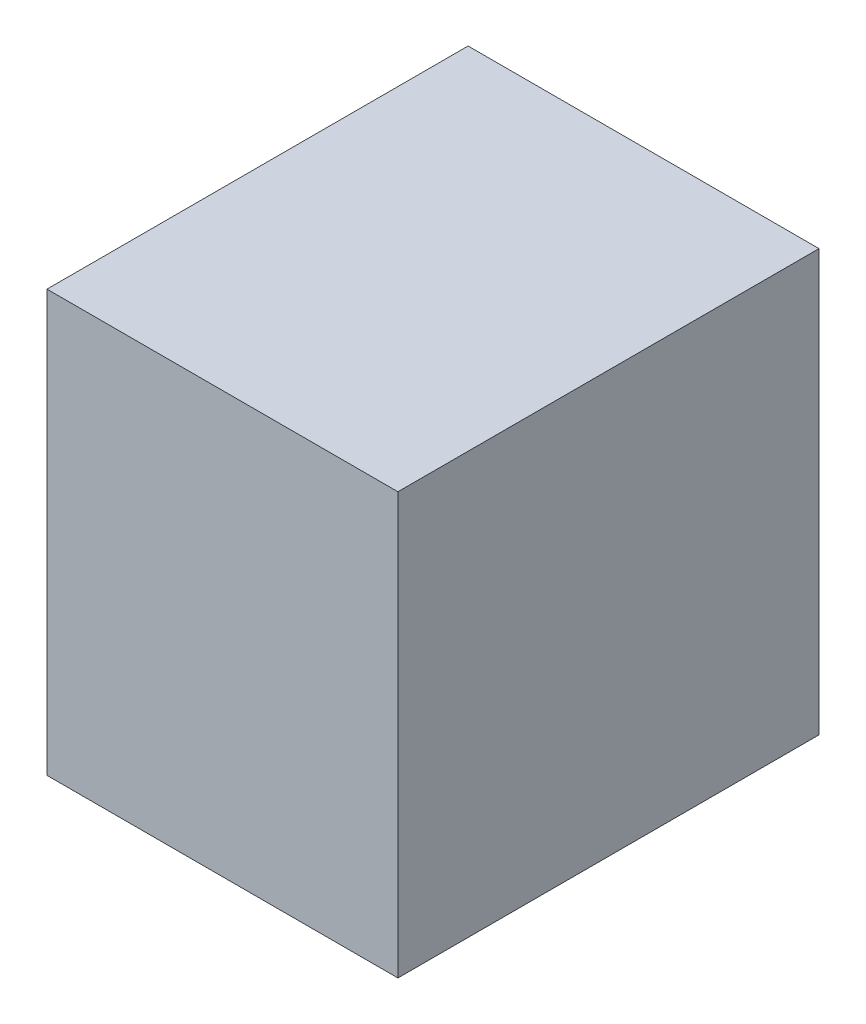
ISO-10303-21;
HEADER;
FILE_DESCRIPTION(('STEP AP214'),'2;1');
FILE_NAME('part.step','',(''),(''),'','','');
FILE_SCHEMA(('AUTOMOTIVE_DESIGN { 1 0 10303 214 1 1 1 1 }'));
ENDSEC;
DATA;
#1=APPLICATION_CONTEXT('core data for automotive mechanical design processes');
#2=APPLICATION_PROTOCOL_DEFINITION('international standard','automotive_design',2000,#1);
#3=PRODUCT_CONTEXT('',#1,'mechanical');
#4=PRODUCT('Part','Part','',(#3));
#5=PRODUCT_RELATED_PRODUCT_CATEGORY('part','',(#4));
#6=PRODUCT_DEFINITION_FORMATION('','',#4);
#7=PRODUCT_DEFINITION_CONTEXT('part definition',#1,'design');
#8=PRODUCT_DEFINITION('design','',#6,#7);
#9=PRODUCT_DEFINITION_SHAPE('','',#8);
#10=(LENGTH_UNIT() NAMED_UNIT(*) SI_UNIT(.MILLI.,.METRE.));
#11=(NAMED_UNIT(*) PLANE_ANGLE_UNIT() SI_UNIT($,.RADIAN.));
#12=(NAMED_UNIT(*) SI_UNIT($,.STERADIAN.) SOLID_ANGLE_UNIT());
#13=UNCERTAINTY_MEASURE_WITH_UNIT(LENGTH_MEASURE(1.E-05),#10,'distance_accuracy_value','');
#14=(GEOMETRIC_REPRESENTATION_CONTEXT(3) GLOBAL_UNCERTAINTY_ASSIGNED_CONTEXT((#13)) GLOBAL_UNIT_ASSIGNED_CONTEXT((#10,
#11,#12)) REPRESENTATION_CONTEXT('',''));
#15=CARTESIAN_POINT('',(0.,0.,0.));
#16=DIRECTION('',(0.,0.,1.));
#17=DIRECTION('',(1.,0.,0.));
#18=AXIS2_PLACEMENT_3D('',#15,#16,#17);
#19=CARTESIAN_POINT('',(-254.,609.6,304.8));
#20=DIRECTION('',(1.,0.,0.));
#21=DIRECTION('',(0.,0.,-1.));
#22=AXIS2_PLACEMENT_3D('',#19,#20,#21);
#23=PLANE('',#22);
#24=DIRECTION('',(0.,0.,1.));
#25=VECTOR('',#24,1.);
#26=CARTESIAN_POINT('',(-254.,0.,304.8));
#27=LINE('',#26,#25);
#28=CARTESIAN_POINT('',(-254.,0.,-304.8));
#29=VERTEX_POINT('',#28);
#30=CARTESIAN_POINT('',(-254.,0.,304.8));
#31=VERTEX_POINT('',#30);
#32=EDGE_CURVE('E100',#29,#31,#27,.T.);
#33=ORIENTED_EDGE('',*,*,#32,.T.);
#34=DIRECTION('',(0.,-1.,0.));
#35=VECTOR('',#34,1.);
#36=CARTESIAN_POINT('',(-254.,609.6,304.8));
#37=LINE('',#36,#35);
#38=CARTESIAN_POINT('',(-254.,609.6,304.8));
#39=VERTEX_POINT('',#38);
#40=EDGE_CURVE('E11',#39,#31,#37,.T.);
#41=ORIENTED_EDGE('',*,*,#40,.F.);
#42=DIRECTION('',(0.,0.,1.));
#43=VECTOR('',#42,1.);
#44=CARTESIAN_POINT('',(-254.,609.6,304.8));
#45=LINE('',#44,#43);
#46=CARTESIAN_POINT('',(-254.,609.6,-304.8));
#47=VERTEX_POINT('',#46);
#48=EDGE_CURVE('E88',#47,#39,#45,.T.);
#49=ORIENTED_EDGE('',*,*,#48,.F.);
#50=DIRECTION('',(0.,-1.,0.));
#51=VECTOR('',#50,1.);
#52=CARTESIAN_POINT('',(-254.,609.6,-304.8));
#53=LINE('',#52,#51);
#54=EDGE_CURVE('E96',#47,#29,#53,.T.);
#55=ORIENTED_EDGE('',*,*,#54,.T.);
#56=EDGE_LOOP('',(#33,#41,#49,#55));
#57=FACE_BOUND('',#56,.T.);
#58=ADVANCED_FACE('F37',(#57),#23,.F.);
#59=CARTESIAN_POINT('',(254.,609.6,304.8));
#60=DIRECTION('',(0.,0.,-1.));
#61=DIRECTION('',(-1.,0.,0.));
#62=AXIS2_PLACEMENT_3D('',#59,#60,#61);
#63=PLANE('',#62);
#64=DIRECTION('',(1.,0.,0.));
#65=VECTOR('',#64,1.);
#66=CARTESIAN_POINT('',(254.,0.,304.8));
#67=LINE('',#66,#65);
#68=CARTESIAN_POINT('',(254.,0.,304.8));
#69=VERTEX_POINT('',#68);
#70=EDGE_CURVE('E92',#31,#69,#67,.T.);
#71=ORIENTED_EDGE('',*,*,#70,.T.);
#72=DIRECTION('',(0.,-1.,0.));
#73=VECTOR('',#72,1.);
#74=CARTESIAN_POINT('',(254.,609.6,304.8));
#75=LINE('',#74,#73);
#76=CARTESIAN_POINT('',(254.,609.6,304.8));
#77=VERTEX_POINT('',#76);
#78=EDGE_CURVE('E45',#77,#69,#75,.T.);
#79=ORIENTED_EDGE('',*,*,#78,.F.);
#80=DIRECTION('',(1.,0.,0.));
#81=VECTOR('',#80,1.);
#82=CARTESIAN_POINT('',(254.,609.6,304.8));
#83=LINE('',#82,#81);
#84=EDGE_CURVE('E83',#39,#77,#83,.T.);
#85=ORIENTED_EDGE('',*,*,#84,.F.);
#86=ORIENTED_EDGE('',*,*,#40,.T.);
#87=EDGE_LOOP('',(#71,#79,#85,#86));
#88=FACE_BOUND('',#87,.T.);
#89=ADVANCED_FACE('F91',(#88),#63,.F.);
#90=CARTESIAN_POINT('',(254.,609.6,304.8));
#91=DIRECTION('',(-1.,0.,0.));
#92=DIRECTION('',(0.,0.,1.));
#93=AXIS2_PLACEMENT_3D('',#90,#91,#92);
#94=PLANE('',#93);
#95=DIRECTION('',(0.,0.,-1.));
#96=VECTOR('',#95,1.);
#97=CARTESIAN_POINT('',(254.,0.,304.8));
#98=LINE('',#97,#96);
#99=CARTESIAN_POINT('',(254.,0.,-304.8));
#100=VERTEX_POINT('',#99);
#101=EDGE_CURVE('E70',#69,#100,#98,.T.);
#102=ORIENTED_EDGE('',*,*,#101,.T.);
#103=DIRECTION('',(0.,-1.,0.));
#104=VECTOR('',#103,1.);
#105=CARTESIAN_POINT('',(254.,609.6,-304.8));
#106=LINE('',#105,#104);
#107=CARTESIAN_POINT('',(254.,609.6,-304.8));
#108=VERTEX_POINT('',#107);
#109=EDGE_CURVE('E93',#108,#100,#106,.T.);
#110=ORIENTED_EDGE('',*,*,#109,.F.);
#111=DIRECTION('',(0.,0.,-1.));
#112=VECTOR('',#111,1.);
#113=CARTESIAN_POINT('',(254.,609.6,304.8));
#114=LINE('',#113,#112);
#115=EDGE_CURVE('E86',#77,#108,#114,.T.);
#116=ORIENTED_EDGE('',*,*,#115,.F.);
#117=ORIENTED_EDGE('',*,*,#78,.T.);
#118=EDGE_LOOP('',(#102,#110,#116,#117));
#119=FACE_BOUND('',#118,.T.);
#120=ADVANCED_FACE('F94',(#119),#94,.F.);
#121=CARTESIAN_POINT('',(254.,609.6,-304.8));
#122=DIRECTION('',(0.,0.,1.));
#123=DIRECTION('',(1.,0.,0.));
#124=AXIS2_PLACEMENT_3D('',#121,#122,#123);
#125=PLANE('',#124);
#126=DIRECTION('',(-1.,0.,0.));
#127=VECTOR('',#126,1.);
#128=CARTESIAN_POINT('',(254.,0.,-304.8));
#129=LINE('',#128,#127);
#130=EDGE_CURVE('E76',#100,#29,#129,.T.);
#131=ORIENTED_EDGE('',*,*,#130,.T.);
#132=ORIENTED_EDGE('',*,*,#54,.F.);
#133=DIRECTION('',(-1.,0.,0.));
#134=VECTOR('',#133,1.);
#135=CARTESIAN_POINT('',(254.,609.6,-304.8));
#136=LINE('',#135,#134);
#137=EDGE_CURVE('E53',#108,#47,#136,.T.);
#138=ORIENTED_EDGE('',*,*,#137,.F.);
#139=ORIENTED_EDGE('',*,*,#109,.T.);
#140=EDGE_LOOP('',(#131,#132,#138,#139));
#141=FACE_BOUND('',#140,.T.);
#142=ADVANCED_FACE('F107',(#141),#125,.F.);
#143=CARTESIAN_POINT('',(0.,609.6,0.));
#144=DIRECTION('',(0.,1.,0.));
#145=DIRECTION('',(0.,0.,1.));
#146=AXIS2_PLACEMENT_3D('',#143,#144,#145);
#147=PLANE('',#146);
#148=ORIENTED_EDGE('',*,*,#48,.T.);
#149=ORIENTED_EDGE('',*,*,#84,.T.);
#150=ORIENTED_EDGE('',*,*,#115,.T.);
#151=ORIENTED_EDGE('',*,*,#137,.T.);
#152=EDGE_LOOP('',(#148,#149,#150,#151));
#153=FACE_BOUND('',#152,.T.);
#154=ADVANCED_FACE('F84',(#153),#147,.T.);
#155=CARTESIAN_POINT('',(0.,0.,0.));
#156=DIRECTION('',(0.,1.,0.));
#157=DIRECTION('',(0.,0.,1.));
#158=AXIS2_PLACEMENT_3D('',#155,#156,#157);
#159=PLANE('',#158);
#160=ORIENTED_EDGE('',*,*,#32,.F.);
#161=ORIENTED_EDGE('',*,*,#130,.F.);
#162=ORIENTED_EDGE('',*,*,#101,.F.);
#163=ORIENTED_EDGE('',*,*,#70,.F.);
#164=EDGE_LOOP('',(#160,#161,#162,#163));
#165=FACE_BOUND('',#164,.T.);
#166=ADVANCED_FACE('F110',(#165),#159,.F.);
#167=CLOSED_SHELL('',(#58,#89,#120,#142,#154,#166));
#168=MANIFOLD_SOLID_BREP('B2',#167);
#169=ADVANCED_BREP_SHAPE_REPRESENTATION('',(#18,#168),#14);
#170=SHAPE_DEFINITION_REPRESENTATION(#9,#169);
ENDSEC;
END-ISO-10303-21;
